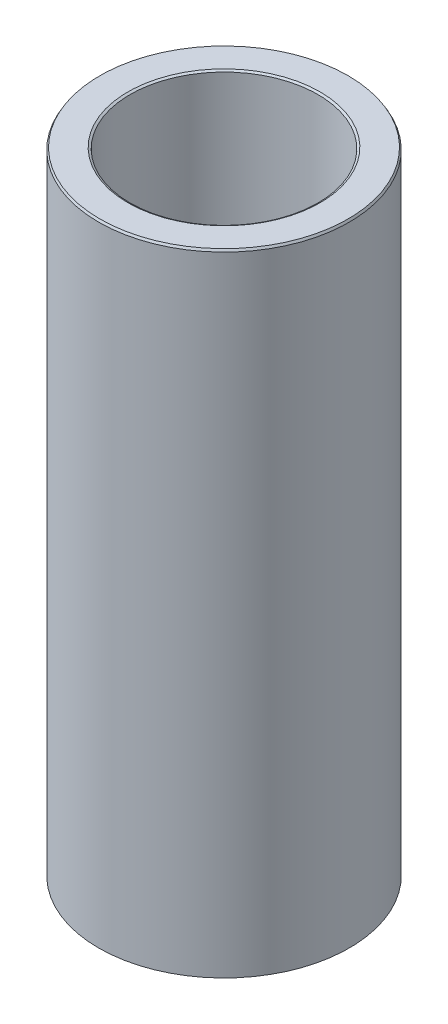
ISO-10303-21;
HEADER;
FILE_DESCRIPTION(('STEP AP214'),'2;1');
FILE_NAME('part.step','',(''),(''),'','','');
FILE_SCHEMA(('AUTOMOTIVE_DESIGN { 1 0 10303 214 1 1 1 1 }'));
ENDSEC;
DATA;
#1=APPLICATION_CONTEXT('core data for automotive mechanical design processes');
#2=APPLICATION_PROTOCOL_DEFINITION('international standard','automotive_design',2000,#1);
#3=PRODUCT_CONTEXT('',#1,'mechanical');
#4=PRODUCT('Part','Part','',(#3));
#5=PRODUCT_RELATED_PRODUCT_CATEGORY('part','',(#4));
#6=PRODUCT_DEFINITION_FORMATION('','',#4);
#7=PRODUCT_DEFINITION_CONTEXT('part definition',#1,'design');
#8=PRODUCT_DEFINITION('design','',#6,#7);
#9=PRODUCT_DEFINITION_SHAPE('','',#8);
#10=(LENGTH_UNIT() NAMED_UNIT(*) SI_UNIT(.MILLI.,.METRE.));
#11=(NAMED_UNIT(*) PLANE_ANGLE_UNIT() SI_UNIT($,.RADIAN.));
#12=(NAMED_UNIT(*) SI_UNIT($,.STERADIAN.) SOLID_ANGLE_UNIT());
#13=UNCERTAINTY_MEASURE_WITH_UNIT(LENGTH_MEASURE(1.E-05),#10,'distance_accuracy_value','');
#14=(GEOMETRIC_REPRESENTATION_CONTEXT(3) GLOBAL_UNCERTAINTY_ASSIGNED_CONTEXT((#13)) GLOBAL_UNIT_ASSIGNED_CONTEXT((#10,
#11,#12)) REPRESENTATION_CONTEXT('',''));
#15=CARTESIAN_POINT('',(0.,0.,0.));
#16=DIRECTION('',(0.,0.,1.));
#17=DIRECTION('',(1.,0.,0.));
#18=AXIS2_PLACEMENT_3D('',#15,#16,#17);
#19=CARTESIAN_POINT('',(0.,277.299631455904,0.));
#20=DIRECTION('',(0.,-1.,0.));
#21=DIRECTION('',(0.,0.,-1.));
#22=AXIS2_PLACEMENT_3D('',#19,#20,#21);
#23=CYLINDRICAL_SURFACE('',#22,55.);
#24=CARTESIAN_POINT('',(0.,0.540205237283764,0.));
#25=DIRECTION('',(0.,1.,0.));
#26=DIRECTION('',(0.,0.,1.));
#27=AXIS2_PLACEMENT_3D('',#24,#25,#26);
#28=CIRCLE('',#27,55.);
#29=CARTESIAN_POINT('',(0.,0.540205237283764,55.));
#30=VERTEX_POINT('',#29);
#31=EDGE_CURVE('E10',#30,#30,#28,.T.);
#32=ORIENTED_EDGE('',*,*,#31,.T.);
#33=EDGE_LOOP('',(#32));
#34=FACE_BOUND('',#33,.T.);
#35=CARTESIAN_POINT('',(0.,276.363968538413,0.));
#36=DIRECTION('',(0.,1.,0.));
#37=DIRECTION('',(0.,0.,1.));
#38=AXIS2_PLACEMENT_3D('',#35,#36,#37);
#39=CIRCLE('',#38,55.);
#40=CARTESIAN_POINT('',(0.,276.363968538413,55.));
#41=VERTEX_POINT('',#40);
#42=EDGE_CURVE('E50',#41,#41,#39,.F.);
#43=ORIENTED_EDGE('',*,*,#42,.T.);
#44=EDGE_LOOP('',(#43));
#45=FACE_BOUND('',#44,.T.);
#46=ADVANCED_FACE('F39',(#34,#45),#23,.T.);
#47=CARTESIAN_POINT('',(0.,277.299631455904,0.));
#48=DIRECTION('',(0.,1.,0.));
#49=DIRECTION('',(0.,0.,1.));
#50=AXIS2_PLACEMENT_3D('',#47,#48,#49);
#51=PLANE('',#50);
#52=CARTESIAN_POINT('',(0.,277.299631455904,0.));
#53=DIRECTION('',(0.,1.,0.));
#54=DIRECTION('',(0.,0.,1.));
#55=AXIS2_PLACEMENT_3D('',#52,#53,#54);
#56=CIRCLE('',#55,42.1605156671949);
#57=CARTESIAN_POINT('',(0.,277.299631455904,42.1605156671949));
#58=VERTEX_POINT('',#57);
#59=EDGE_CURVE('E58',#58,#58,#56,.F.);
#60=ORIENTED_EDGE('',*,*,#59,.T.);
#61=EDGE_LOOP('',(#60));
#62=FACE_BOUND('',#61,.T.);
#63=CARTESIAN_POINT('',(0.,277.299631455904,0.));
#64=DIRECTION('',(0.,1.,0.));
#65=DIRECTION('',(0.,0.,1.));
#66=AXIS2_PLACEMENT_3D('',#63,#64,#65);
#67=CIRCLE('',#66,54.4597947627161);
#68=CARTESIAN_POINT('',(0.,277.299631455904,54.4597947627161));
#69=VERTEX_POINT('',#68);
#70=EDGE_CURVE('E61',#69,#69,#67,.T.);
#71=ORIENTED_EDGE('',*,*,#70,.T.);
#72=EDGE_LOOP('',(#71));
#73=FACE_BOUND('',#72,.T.);
#74=ADVANCED_FACE('F88',(#62,#73),#51,.T.);
#75=CARTESIAN_POINT('',(0.,0.,0.));
#76=DIRECTION('',(0.,1.,0.));
#77=DIRECTION('',(0.,0.,1.));
#78=AXIS2_PLACEMENT_3D('',#75,#76,#77);
#79=PLANE('',#78);
#80=CARTESIAN_POINT('',(0.,0.,0.));
#81=DIRECTION('',(0.,1.,0.));
#82=DIRECTION('',(0.,0.,1.));
#83=AXIS2_PLACEMENT_3D('',#80,#81,#82);
#84=CIRCLE('',#83,41.7650579869884);
#85=CARTESIAN_POINT('',(0.,0.,41.7650579869884));
#86=VERTEX_POINT('',#85);
#87=EDGE_CURVE('E51',#86,#86,#84,.T.);
#88=ORIENTED_EDGE('',*,*,#87,.T.);
#89=EDGE_LOOP('',(#88));
#90=FACE_BOUND('',#89,.T.);
#91=CARTESIAN_POINT('',(0.,0.,0.));
#92=DIRECTION('',(0.,1.,0.));
#93=DIRECTION('',(0.,0.,1.));
#94=AXIS2_PLACEMENT_3D('',#91,#92,#93);
#95=CIRCLE('',#94,54.0643370825097);
#96=CARTESIAN_POINT('',(0.,0.,54.0643370825097));
#97=VERTEX_POINT('',#96);
#98=EDGE_CURVE('E54',#97,#97,#95,.F.);
#99=ORIENTED_EDGE('',*,*,#98,.T.);
#100=EDGE_LOOP('',(#99));
#101=FACE_BOUND('',#100,.T.);
#102=ADVANCED_FACE('F83',(#90,#101),#79,.F.);
#103=CARTESIAN_POINT('',(0.,277.299631455904,0.));
#104=DIRECTION('',(0.,-1.,0.));
#105=DIRECTION('',(0.,0.,-1.));
#106=AXIS2_PLACEMENT_3D('',#103,#104,#105);
#107=CYLINDRICAL_SURFACE('',#106,41.2248527497046);
#108=CARTESIAN_POINT('',(0.,276.75942621862,0.));
#109=DIRECTION('',(0.,1.,0.));
#110=DIRECTION('',(0.,0.,1.));
#111=AXIS2_PLACEMENT_3D('',#108,#109,#110);
#112=CIRCLE('',#111,41.2248527497046);
#113=CARTESIAN_POINT('',(0.,276.75942621862,41.2248527497046));
#114=VERTEX_POINT('',#113);
#115=EDGE_CURVE('E67',#114,#114,#112,.T.);
#116=ORIENTED_EDGE('',*,*,#115,.T.);
#117=EDGE_LOOP('',(#116));
#118=FACE_BOUND('',#117,.T.);
#119=CARTESIAN_POINT('',(0.,0.935662917490365,0.));
#120=DIRECTION('',(0.,1.,0.));
#121=DIRECTION('',(0.,0.,1.));
#122=AXIS2_PLACEMENT_3D('',#119,#120,#121);
#123=CIRCLE('',#122,41.2248527497046);
#124=CARTESIAN_POINT('',(0.,0.935662917490365,41.2248527497046));
#125=VERTEX_POINT('',#124);
#126=EDGE_CURVE('E69',#125,#125,#123,.F.);
#127=ORIENTED_EDGE('',*,*,#126,.T.);
#128=EDGE_LOOP('',(#127));
#129=FACE_BOUND('',#128,.T.);
#130=ADVANCED_FACE('F71',(#118,#129),#107,.F.);
#131=CARTESIAN_POINT('',(0.,276.75942621862,0.));
#132=DIRECTION('',(0.,1.,0.));
#133=DIRECTION('',(0.,0.,1.));
#134=AXIS2_PLACEMENT_3D('',#131,#132,#133);
#135=CONICAL_SURFACE('',#134,41.2248527497046,1.04719755119658);
#136=ORIENTED_EDGE('',*,*,#59,.F.);
#137=EDGE_LOOP('',(#136));
#138=FACE_BOUND('',#137,.T.);
#139=ORIENTED_EDGE('',*,*,#115,.F.);
#140=EDGE_LOOP('',(#139));
#141=FACE_BOUND('',#140,.T.);
#142=ADVANCED_FACE('F77',(#138,#141),#135,.F.);
#143=CARTESIAN_POINT('',(0.,0.,0.));
#144=DIRECTION('',(0.,-1.,0.));
#145=DIRECTION('',(0.,0.,-1.));
#146=AXIS2_PLACEMENT_3D('',#143,#144,#145);
#147=CONICAL_SURFACE('',#146,41.7650579869884,0.52359877559831);
#148=ORIENTED_EDGE('',*,*,#126,.F.);
#149=EDGE_LOOP('',(#148));
#150=FACE_BOUND('',#149,.T.);
#151=ORIENTED_EDGE('',*,*,#87,.F.);
#152=EDGE_LOOP('',(#151));
#153=FACE_BOUND('',#152,.T.);
#154=ADVANCED_FACE('F73',(#150,#153),#147,.F.);
#155=CARTESIAN_POINT('',(0.,0.540205237283764,0.));
#156=DIRECTION('',(0.,1.,0.));
#157=DIRECTION('',(0.,0.,1.));
#158=AXIS2_PLACEMENT_3D('',#155,#156,#157);
#159=CONICAL_SURFACE('',#158,55.,1.04719755119662);
#160=ORIENTED_EDGE('',*,*,#98,.F.);
#161=EDGE_LOOP('',(#160));
#162=FACE_BOUND('',#161,.T.);
#163=ORIENTED_EDGE('',*,*,#31,.F.);
#164=EDGE_LOOP('',(#163));
#165=FACE_BOUND('',#164,.T.);
#166=ADVANCED_FACE('F76',(#162,#165),#159,.T.);
#167=CARTESIAN_POINT('',(0.,277.299631455904,0.));
#168=DIRECTION('',(0.,-1.,0.));
#169=DIRECTION('',(0.,0.,-1.));
#170=AXIS2_PLACEMENT_3D('',#167,#168,#169);
#171=CONICAL_SURFACE('',#170,54.4597947627161,0.523598775598306);
#172=ORIENTED_EDGE('',*,*,#42,.F.);
#173=EDGE_LOOP('',(#172));
#174=FACE_BOUND('',#173,.T.);
#175=ORIENTED_EDGE('',*,*,#70,.F.);
#176=EDGE_LOOP('',(#175));
#177=FACE_BOUND('',#176,.T.);
#178=ADVANCED_FACE('F45',(#174,#177),#171,.T.);
#179=CLOSED_SHELL('',(#46,#74,#102,#130,#142,#154,#166,#178));
#180=MANIFOLD_SOLID_BREP('B2',#179);
#181=ADVANCED_BREP_SHAPE_REPRESENTATION('',(#18,#180),#14);
#182=SHAPE_DEFINITION_REPRESENTATION(#9,#181);
ENDSEC;
END-ISO-10303-21;
